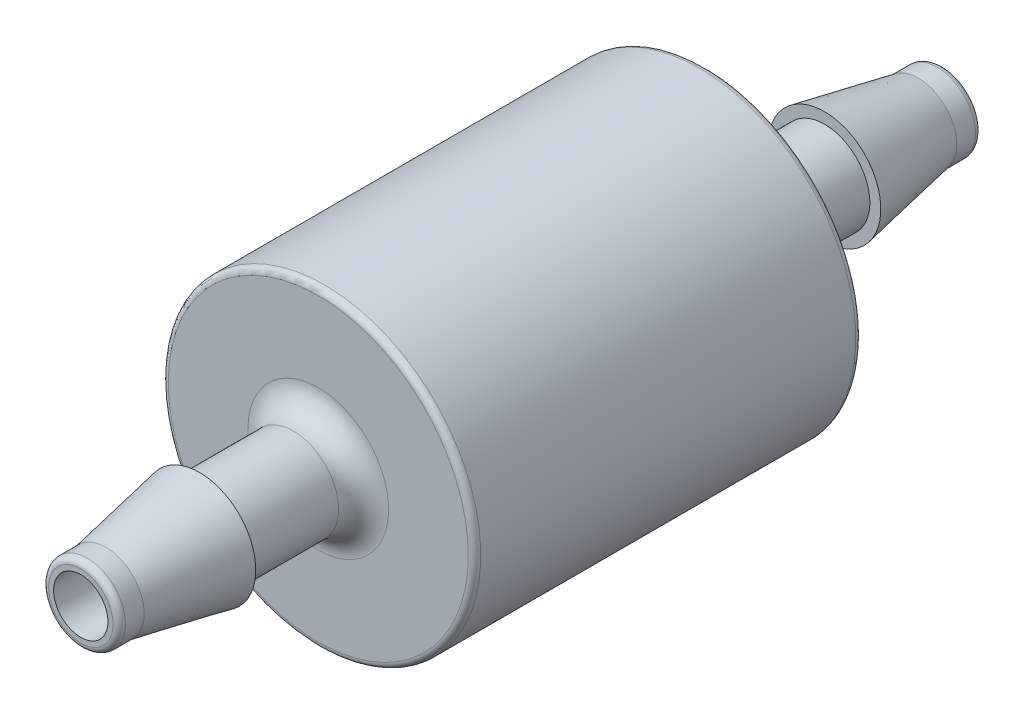
ISO-10303-21;
HEADER;
FILE_DESCRIPTION(('STEP AP214'),'2;1');
FILE_NAME('part.step','',(''),(''),'','','');
FILE_SCHEMA(('AUTOMOTIVE_DESIGN { 1 0 10303 214 1 1 1 1 }'));
ENDSEC;
DATA;
#1=APPLICATION_CONTEXT('core data for automotive mechanical design processes');
#2=APPLICATION_PROTOCOL_DEFINITION('international standard','automotive_design',2000,#1);
#3=PRODUCT_CONTEXT('',#1,'mechanical');
#4=PRODUCT('Part','Part','',(#3));
#5=PRODUCT_RELATED_PRODUCT_CATEGORY('part','',(#4));
#6=PRODUCT_DEFINITION_FORMATION('','',#4);
#7=PRODUCT_DEFINITION_CONTEXT('part definition',#1,'design');
#8=PRODUCT_DEFINITION('design','',#6,#7);
#9=PRODUCT_DEFINITION_SHAPE('','',#8);
#10=(LENGTH_UNIT() NAMED_UNIT(*) SI_UNIT(.MILLI.,.METRE.));
#11=(NAMED_UNIT(*) PLANE_ANGLE_UNIT() SI_UNIT($,.RADIAN.));
#12=(NAMED_UNIT(*) SI_UNIT($,.STERADIAN.) SOLID_ANGLE_UNIT());
#13=UNCERTAINTY_MEASURE_WITH_UNIT(LENGTH_MEASURE(1.E-05),#10,'distance_accuracy_value','');
#14=(GEOMETRIC_REPRESENTATION_CONTEXT(3) GLOBAL_UNCERTAINTY_ASSIGNED_CONTEXT((#13)) GLOBAL_UNIT_ASSIGNED_CONTEXT((#10,
#11,#12)) REPRESENTATION_CONTEXT('',''));
#15=CARTESIAN_POINT('',(0.,0.,0.));
#16=DIRECTION('',(0.,0.,1.));
#17=DIRECTION('',(1.,0.,0.));
#18=AXIS2_PLACEMENT_3D('',#15,#16,#17);
#19=CARTESIAN_POINT('',(0.,-2.286,12.7));
#20=DIRECTION('',(0.,0.,-1.));
#21=DIRECTION('',(-1.,0.,0.));
#22=AXIS2_PLACEMENT_3D('',#19,#20,#21);
#23=PLANE('',#22);
#24=CARTESIAN_POINT('',(0.,0.,12.7));
#25=DIRECTION('',(0.,0.,-1.));
#26=DIRECTION('',(-1.,0.,0.));
#27=AXIS2_PLACEMENT_3D('',#24,#25,#26);
#28=CIRCLE('',#27,2.28599999999999);
#29=CARTESIAN_POINT('',(-2.28599999999999,0.,12.7));
#30=VERTEX_POINT('',#29);
#31=EDGE_CURVE('E10',#30,#30,#28,.T.);
#32=ORIENTED_EDGE('',*,*,#31,.T.);
#33=EDGE_LOOP('',(#32));
#34=FACE_BOUND('',#33,.T.);
#35=CARTESIAN_POINT('',(0.,0.,12.7));
#36=DIRECTION('',(0.,0.,-1.));
#37=DIRECTION('',(-1.,0.,0.));
#38=AXIS2_PLACEMENT_3D('',#35,#36,#37);
#39=CIRCLE('',#38,1.84149999999999);
#40=CARTESIAN_POINT('',(-1.84149999999999,0.,12.7));
#41=VERTEX_POINT('',#40);
#42=EDGE_CURVE('E94',#41,#41,#39,.T.);
#43=ORIENTED_EDGE('',*,*,#42,.F.);
#44=EDGE_LOOP('',(#43));
#45=FACE_BOUND('',#44,.T.);
#46=ADVANCED_FACE('F30',(#34,#45),#23,.T.);
#47=CARTESIAN_POINT('',(0.,0.,12.7));
#48=DIRECTION('',(0.,0.,-1.));
#49=DIRECTION('',(-1.,0.,0.));
#50=AXIS2_PLACEMENT_3D('',#47,#48,#49);
#51=CONICAL_SURFACE('',#50,2.28599999999999,0.187761946513594);
#52=CARTESIAN_POINT('',(0.,0.,16.51));
#53=DIRECTION('',(0.,0.,-1.));
#54=DIRECTION('',(-1.,0.,0.));
#55=AXIS2_PLACEMENT_3D('',#52,#53,#54);
#56=CIRCLE('',#55,1.56209999999999);
#57=CARTESIAN_POINT('',(-1.56209999999999,0.,16.51));
#58=VERTEX_POINT('',#57);
#59=EDGE_CURVE('E36',#58,#58,#56,.T.);
#60=ORIENTED_EDGE('',*,*,#59,.T.);
#61=EDGE_LOOP('',(#60));
#62=FACE_BOUND('',#61,.T.);
#63=ORIENTED_EDGE('',*,*,#31,.F.);
#64=EDGE_LOOP('',(#63));
#65=FACE_BOUND('',#64,.T.);
#66=ADVANCED_FACE('F102',(#62,#65),#51,.T.);
#67=CARTESIAN_POINT('',(0.,0.,-17.526));
#68=DIRECTION('',(0.,0.,-1.));
#69=DIRECTION('',(-1.,0.,0.));
#70=AXIS2_PLACEMENT_3D('',#67,#68,#69);
#71=CYLINDRICAL_SURFACE('',#70,1.56209999999999);
#72=CARTESIAN_POINT('',(0.,0.,17.272));
#73=DIRECTION('',(0.,0.,-1.));
#74=DIRECTION('',(-1.,0.,0.));
#75=AXIS2_PLACEMENT_3D('',#72,#73,#74);
#76=CIRCLE('',#75,1.56209999999999);
#77=CARTESIAN_POINT('',(-1.56209999999999,0.,17.272));
#78=VERTEX_POINT('',#77);
#79=EDGE_CURVE('E40',#78,#78,#76,.T.);
#80=ORIENTED_EDGE('',*,*,#79,.T.);
#81=EDGE_LOOP('',(#80));
#82=FACE_BOUND('',#81,.T.);
#83=ORIENTED_EDGE('',*,*,#59,.F.);
#84=EDGE_LOOP('',(#83));
#85=FACE_BOUND('',#84,.T.);
#86=ADVANCED_FACE('F106',(#82,#85),#71,.T.);
#87=CARTESIAN_POINT('',(0.,0.,17.272));
#88=DIRECTION('',(0.,0.,-1.));
#89=DIRECTION('',(-1.,0.,0.));
#90=AXIS2_PLACEMENT_3D('',#87,#88,#89);
#91=TOROIDAL_SURFACE('',#90,1.30809999999999,0.254);
#92=CARTESIAN_POINT('',(0.,0.,17.526));
#93=DIRECTION('',(0.,0.,-1.));
#94=DIRECTION('',(-1.,0.,0.));
#95=AXIS2_PLACEMENT_3D('',#92,#93,#94);
#96=CIRCLE('',#95,1.30809999999999);
#97=CARTESIAN_POINT('',(-1.30809999999999,0.,17.526));
#98=VERTEX_POINT('',#97);
#99=EDGE_CURVE('E44',#98,#98,#96,.T.);
#100=ORIENTED_EDGE('',*,*,#99,.T.);
#101=EDGE_LOOP('',(#100));
#102=FACE_BOUND('',#101,.T.);
#103=ORIENTED_EDGE('',*,*,#79,.F.);
#104=EDGE_LOOP('',(#103));
#105=FACE_BOUND('',#104,.T.);
#106=ADVANCED_FACE('F110',(#102,#105),#91,.T.);
#107=CARTESIAN_POINT('',(0.,-1.1049,17.526));
#108=DIRECTION('',(0.,0.,1.));
#109=DIRECTION('',(1.,0.,0.));
#110=AXIS2_PLACEMENT_3D('',#107,#108,#109);
#111=PLANE('',#110);
#112=CARTESIAN_POINT('',(0.,0.,17.526));
#113=DIRECTION('',(0.,0.,-1.));
#114=DIRECTION('',(-1.,0.,0.));
#115=AXIS2_PLACEMENT_3D('',#112,#113,#114);
#116=CIRCLE('',#115,1.1049);
#117=CARTESIAN_POINT('',(-1.1049,0.,17.526));
#118=VERTEX_POINT('',#117);
#119=EDGE_CURVE('E49',#118,#118,#116,.T.);
#120=ORIENTED_EDGE('',*,*,#119,.T.);
#121=EDGE_LOOP('',(#120));
#122=FACE_BOUND('',#121,.T.);
#123=ORIENTED_EDGE('',*,*,#99,.F.);
#124=EDGE_LOOP('',(#123));
#125=FACE_BOUND('',#124,.T.);
#126=ADVANCED_FACE('F117',(#122,#125),#111,.T.);
#127=CARTESIAN_POINT('',(0.,0.,-17.526));
#128=DIRECTION('',(0.,0.,-1.));
#129=DIRECTION('',(-1.,0.,0.));
#130=AXIS2_PLACEMENT_3D('',#127,#128,#129);
#131=CYLINDRICAL_SURFACE('',#130,1.1049);
#132=CARTESIAN_POINT('',(0.,0.,-17.526));
#133=DIRECTION('',(0.,0.,-1.));
#134=DIRECTION('',(-1.,0.,0.));
#135=AXIS2_PLACEMENT_3D('',#132,#133,#134);
#136=CIRCLE('',#135,1.1049);
#137=CARTESIAN_POINT('',(-1.1049,0.,-17.526));
#138=VERTEX_POINT('',#137);
#139=EDGE_CURVE('E52',#138,#138,#136,.T.);
#140=ORIENTED_EDGE('',*,*,#139,.T.);
#141=EDGE_LOOP('',(#140));
#142=FACE_BOUND('',#141,.T.);
#143=ORIENTED_EDGE('',*,*,#119,.F.);
#144=EDGE_LOOP('',(#143));
#145=FACE_BOUND('',#144,.T.);
#146=ADVANCED_FACE('F121',(#142,#145),#131,.F.);
#147=CARTESIAN_POINT('',(0.,-1.1049,-17.526));
#148=DIRECTION('',(0.,0.,-1.));
#149=DIRECTION('',(-1.,0.,0.));
#150=AXIS2_PLACEMENT_3D('',#147,#148,#149);
#151=PLANE('',#150);
#152=CARTESIAN_POINT('',(0.,0.,-17.526));
#153=DIRECTION('',(0.,0.,-1.));
#154=DIRECTION('',(-1.,0.,0.));
#155=AXIS2_PLACEMENT_3D('',#152,#153,#154);
#156=CIRCLE('',#155,1.30809999999999);
#157=CARTESIAN_POINT('',(-1.30809999999999,0.,-17.526));
#158=VERTEX_POINT('',#157);
#159=EDGE_CURVE('E55',#158,#158,#156,.T.);
#160=ORIENTED_EDGE('',*,*,#159,.T.);
#161=EDGE_LOOP('',(#160));
#162=FACE_BOUND('',#161,.T.);
#163=ORIENTED_EDGE('',*,*,#139,.F.);
#164=EDGE_LOOP('',(#163));
#165=FACE_BOUND('',#164,.T.);
#166=ADVANCED_FACE('F125',(#162,#165),#151,.T.);
#167=CARTESIAN_POINT('',(0.,0.,-17.272));
#168=DIRECTION('',(0.,0.,-1.));
#169=DIRECTION('',(-1.,0.,0.));
#170=AXIS2_PLACEMENT_3D('',#167,#168,#169);
#171=TOROIDAL_SURFACE('',#170,1.30809999999999,0.254);
#172=CARTESIAN_POINT('',(0.,0.,-17.272));
#173=DIRECTION('',(0.,0.,-1.));
#174=DIRECTION('',(-1.,0.,0.));
#175=AXIS2_PLACEMENT_3D('',#172,#173,#174);
#176=CIRCLE('',#175,1.56209999999999);
#177=CARTESIAN_POINT('',(-1.56209999999999,0.,-17.272));
#178=VERTEX_POINT('',#177);
#179=EDGE_CURVE('E58',#178,#178,#176,.T.);
#180=ORIENTED_EDGE('',*,*,#179,.T.);
#181=EDGE_LOOP('',(#180));
#182=FACE_BOUND('',#181,.T.);
#183=ORIENTED_EDGE('',*,*,#159,.F.);
#184=EDGE_LOOP('',(#183));
#185=FACE_BOUND('',#184,.T.);
#186=ADVANCED_FACE('F129',(#182,#185),#171,.T.);
#187=CARTESIAN_POINT('',(0.,0.,-17.526));
#188=DIRECTION('',(0.,0.,-1.));
#189=DIRECTION('',(-1.,0.,0.));
#190=AXIS2_PLACEMENT_3D('',#187,#188,#189);
#191=CYLINDRICAL_SURFACE('',#190,1.56209999999999);
#192=CARTESIAN_POINT('',(0.,0.,-16.51));
#193=DIRECTION('',(0.,0.,-1.));
#194=DIRECTION('',(-1.,0.,0.));
#195=AXIS2_PLACEMENT_3D('',#192,#193,#194);
#196=CIRCLE('',#195,1.56209999999999);
#197=CARTESIAN_POINT('',(-1.56209999999999,0.,-16.51));
#198=VERTEX_POINT('',#197);
#199=EDGE_CURVE('E61',#198,#198,#196,.T.);
#200=ORIENTED_EDGE('',*,*,#199,.T.);
#201=EDGE_LOOP('',(#200));
#202=FACE_BOUND('',#201,.T.);
#203=ORIENTED_EDGE('',*,*,#179,.F.);
#204=EDGE_LOOP('',(#203));
#205=FACE_BOUND('',#204,.T.);
#206=ADVANCED_FACE('F133',(#202,#205),#191,.T.);
#207=CARTESIAN_POINT('',(0.,0.,-16.51));
#208=DIRECTION('',(0.,0.,1.));
#209=DIRECTION('',(1.,0.,0.));
#210=AXIS2_PLACEMENT_3D('',#207,#208,#209);
#211=CONICAL_SURFACE('',#210,1.56209999999999,0.187761946513594);
#212=CARTESIAN_POINT('',(0.,0.,-12.7));
#213=DIRECTION('',(0.,0.,-1.));
#214=DIRECTION('',(-1.,0.,0.));
#215=AXIS2_PLACEMENT_3D('',#212,#213,#214);
#216=CIRCLE('',#215,2.28599999999999);
#217=CARTESIAN_POINT('',(-2.28599999999999,0.,-12.7));
#218=VERTEX_POINT('',#217);
#219=EDGE_CURVE('E64',#218,#218,#216,.T.);
#220=ORIENTED_EDGE('',*,*,#219,.T.);
#221=EDGE_LOOP('',(#220));
#222=FACE_BOUND('',#221,.T.);
#223=ORIENTED_EDGE('',*,*,#199,.F.);
#224=EDGE_LOOP('',(#223));
#225=FACE_BOUND('',#224,.T.);
#226=ADVANCED_FACE('F137',(#222,#225),#211,.T.);
#227=CARTESIAN_POINT('',(0.,-2.286,-12.7));
#228=DIRECTION('',(0.,0.,1.));
#229=DIRECTION('',(1.,0.,0.));
#230=AXIS2_PLACEMENT_3D('',#227,#228,#229);
#231=PLANE('',#230);
#232=CARTESIAN_POINT('',(0.,0.,-12.7));
#233=DIRECTION('',(0.,0.,-1.));
#234=DIRECTION('',(-1.,0.,0.));
#235=AXIS2_PLACEMENT_3D('',#232,#233,#234);
#236=CIRCLE('',#235,1.84149999999999);
#237=CARTESIAN_POINT('',(-1.84149999999999,0.,-12.7));
#238=VERTEX_POINT('',#237);
#239=EDGE_CURVE('E67',#238,#238,#236,.T.);
#240=ORIENTED_EDGE('',*,*,#239,.T.);
#241=EDGE_LOOP('',(#240));
#242=FACE_BOUND('',#241,.T.);
#243=ORIENTED_EDGE('',*,*,#219,.F.);
#244=EDGE_LOOP('',(#243));
#245=FACE_BOUND('',#244,.T.);
#246=ADVANCED_FACE('F141',(#242,#245),#231,.T.);
#247=CARTESIAN_POINT('',(0.,0.,-17.526));
#248=DIRECTION('',(0.,0.,-1.));
#249=DIRECTION('',(-1.,0.,0.));
#250=AXIS2_PLACEMENT_3D('',#247,#248,#249);
#251=CYLINDRICAL_SURFACE('',#250,1.84149999999999);
#252=CARTESIAN_POINT('',(0.,0.,-8.89));
#253=DIRECTION('',(0.,0.,-1.));
#254=DIRECTION('',(-1.,0.,0.));
#255=AXIS2_PLACEMENT_3D('',#252,#253,#254);
#256=CIRCLE('',#255,1.84149999999999);
#257=CARTESIAN_POINT('',(-1.84149999999999,0.,-8.89));
#258=VERTEX_POINT('',#257);
#259=EDGE_CURVE('E70',#258,#258,#256,.T.);
#260=ORIENTED_EDGE('',*,*,#259,.T.);
#261=EDGE_LOOP('',(#260));
#262=FACE_BOUND('',#261,.T.);
#263=ORIENTED_EDGE('',*,*,#239,.F.);
#264=EDGE_LOOP('',(#263));
#265=FACE_BOUND('',#264,.T.);
#266=ADVANCED_FACE('F145',(#262,#265),#251,.T.);
#267=CARTESIAN_POINT('',(0.,0.,-8.89));
#268=DIRECTION('',(0.,0.,-1.));
#269=DIRECTION('',(-1.,0.,0.));
#270=AXIS2_PLACEMENT_3D('',#267,#268,#269);
#271=TOROIDAL_SURFACE('',#270,2.85749999999999,1.016);
#272=CARTESIAN_POINT('',(0.,0.,-7.874));
#273=DIRECTION('',(0.,0.,-1.));
#274=DIRECTION('',(-1.,0.,0.));
#275=AXIS2_PLACEMENT_3D('',#272,#273,#274);
#276=CIRCLE('',#275,2.85749999999999);
#277=CARTESIAN_POINT('',(-2.85749999999999,0.,-7.874));
#278=VERTEX_POINT('',#277);
#279=EDGE_CURVE('E73',#278,#278,#276,.T.);
#280=ORIENTED_EDGE('',*,*,#279,.T.);
#281=EDGE_LOOP('',(#280));
#282=FACE_BOUND('',#281,.T.);
#283=ORIENTED_EDGE('',*,*,#259,.F.);
#284=EDGE_LOOP('',(#283));
#285=FACE_BOUND('',#284,.T.);
#286=ADVANCED_FACE('F149',(#282,#285),#271,.F.);
#287=CARTESIAN_POINT('',(0.,-2.8575,-7.874));
#288=DIRECTION('',(0.,0.,-1.));
#289=DIRECTION('',(-1.,0.,0.));
#290=AXIS2_PLACEMENT_3D('',#287,#288,#289);
#291=PLANE('',#290);
#292=CARTESIAN_POINT('',(0.,0.,-7.874));
#293=DIRECTION('',(0.,0.,-1.));
#294=DIRECTION('',(-1.,0.,0.));
#295=AXIS2_PLACEMENT_3D('',#292,#293,#294);
#296=CIRCLE('',#295,6.09599999999999);
#297=CARTESIAN_POINT('',(-6.09599999999999,0.,-7.874));
#298=VERTEX_POINT('',#297);
#299=EDGE_CURVE('E76',#298,#298,#296,.T.);
#300=ORIENTED_EDGE('',*,*,#299,.T.);
#301=EDGE_LOOP('',(#300));
#302=FACE_BOUND('',#301,.T.);
#303=ORIENTED_EDGE('',*,*,#279,.F.);
#304=EDGE_LOOP('',(#303));
#305=FACE_BOUND('',#304,.T.);
#306=ADVANCED_FACE('F153',(#302,#305),#291,.T.);
#307=CARTESIAN_POINT('',(0.,0.,-7.62));
#308=DIRECTION('',(0.,0.,-1.));
#309=DIRECTION('',(-1.,0.,0.));
#310=AXIS2_PLACEMENT_3D('',#307,#308,#309);
#311=TOROIDAL_SURFACE('',#310,6.09599999999999,0.254);
#312=CARTESIAN_POINT('',(0.,0.,-7.62));
#313=DIRECTION('',(0.,0.,-1.));
#314=DIRECTION('',(-1.,0.,0.));
#315=AXIS2_PLACEMENT_3D('',#312,#313,#314);
#316=CIRCLE('',#315,6.34999999999999);
#317=CARTESIAN_POINT('',(-6.34999999999999,0.,-7.62));
#318=VERTEX_POINT('',#317);
#319=EDGE_CURVE('E79',#318,#318,#316,.T.);
#320=ORIENTED_EDGE('',*,*,#319,.T.);
#321=EDGE_LOOP('',(#320));
#322=FACE_BOUND('',#321,.T.);
#323=ORIENTED_EDGE('',*,*,#299,.F.);
#324=EDGE_LOOP('',(#323));
#325=FACE_BOUND('',#324,.T.);
#326=ADVANCED_FACE('F157',(#322,#325),#311,.T.);
#327=CARTESIAN_POINT('',(0.,0.,-17.526));
#328=DIRECTION('',(0.,0.,-1.));
#329=DIRECTION('',(-1.,0.,0.));
#330=AXIS2_PLACEMENT_3D('',#327,#328,#329);
#331=CYLINDRICAL_SURFACE('',#330,6.34999999999999);
#332=CARTESIAN_POINT('',(0.,0.,7.61999999999999));
#333=DIRECTION('',(0.,0.,-1.));
#334=DIRECTION('',(-1.,0.,0.));
#335=AXIS2_PLACEMENT_3D('',#332,#333,#334);
#336=CIRCLE('',#335,6.34999999999999);
#337=CARTESIAN_POINT('',(-6.34999999999999,0.,7.61999999999999));
#338=VERTEX_POINT('',#337);
#339=EDGE_CURVE('E82',#338,#338,#336,.T.);
#340=ORIENTED_EDGE('',*,*,#339,.T.);
#341=EDGE_LOOP('',(#340));
#342=FACE_BOUND('',#341,.T.);
#343=ORIENTED_EDGE('',*,*,#319,.F.);
#344=EDGE_LOOP('',(#343));
#345=FACE_BOUND('',#344,.T.);
#346=ADVANCED_FACE('F161',(#342,#345),#331,.T.);
#347=CARTESIAN_POINT('',(0.,0.,7.62));
#348=DIRECTION('',(0.,0.,-1.));
#349=DIRECTION('',(-1.,0.,0.));
#350=AXIS2_PLACEMENT_3D('',#347,#348,#349);
#351=TOROIDAL_SURFACE('',#350,6.09599999999999,0.254);
#352=CARTESIAN_POINT('',(0.,0.,7.874));
#353=DIRECTION('',(0.,0.,-1.));
#354=DIRECTION('',(-1.,0.,0.));
#355=AXIS2_PLACEMENT_3D('',#352,#353,#354);
#356=CIRCLE('',#355,6.09599999999999);
#357=CARTESIAN_POINT('',(-6.09599999999999,0.,7.874));
#358=VERTEX_POINT('',#357);
#359=EDGE_CURVE('E85',#358,#358,#356,.T.);
#360=ORIENTED_EDGE('',*,*,#359,.T.);
#361=EDGE_LOOP('',(#360));
#362=FACE_BOUND('',#361,.T.);
#363=ORIENTED_EDGE('',*,*,#339,.F.);
#364=EDGE_LOOP('',(#363));
#365=FACE_BOUND('',#364,.T.);
#366=ADVANCED_FACE('F165',(#362,#365),#351,.T.);
#367=CARTESIAN_POINT('',(0.,-2.8575,7.874));
#368=DIRECTION('',(0.,0.,1.));
#369=DIRECTION('',(1.,0.,0.));
#370=AXIS2_PLACEMENT_3D('',#367,#368,#369);
#371=PLANE('',#370);
#372=CARTESIAN_POINT('',(0.,0.,7.874));
#373=DIRECTION('',(0.,0.,-1.));
#374=DIRECTION('',(-1.,0.,0.));
#375=AXIS2_PLACEMENT_3D('',#372,#373,#374);
#376=CIRCLE('',#375,2.85749999999999);
#377=CARTESIAN_POINT('',(-2.85749999999999,0.,7.874));
#378=VERTEX_POINT('',#377);
#379=EDGE_CURVE('E88',#378,#378,#376,.T.);
#380=ORIENTED_EDGE('',*,*,#379,.T.);
#381=EDGE_LOOP('',(#380));
#382=FACE_BOUND('',#381,.T.);
#383=ORIENTED_EDGE('',*,*,#359,.F.);
#384=EDGE_LOOP('',(#383));
#385=FACE_BOUND('',#384,.T.);
#386=ADVANCED_FACE('F169',(#382,#385),#371,.T.);
#387=CARTESIAN_POINT('',(0.,0.,8.89));
#388=DIRECTION('',(0.,0.,-1.));
#389=DIRECTION('',(-1.,0.,0.));
#390=AXIS2_PLACEMENT_3D('',#387,#388,#389);
#391=TOROIDAL_SURFACE('',#390,2.85749999999999,1.016);
#392=CARTESIAN_POINT('',(0.,0.,8.89));
#393=DIRECTION('',(0.,0.,-1.));
#394=DIRECTION('',(-1.,0.,0.));
#395=AXIS2_PLACEMENT_3D('',#392,#393,#394);
#396=CIRCLE('',#395,1.84149999999999);
#397=CARTESIAN_POINT('',(-1.84149999999999,0.,8.89));
#398=VERTEX_POINT('',#397);
#399=EDGE_CURVE('E91',#398,#398,#396,.T.);
#400=ORIENTED_EDGE('',*,*,#399,.T.);
#401=EDGE_LOOP('',(#400));
#402=FACE_BOUND('',#401,.T.);
#403=ORIENTED_EDGE('',*,*,#379,.F.);
#404=EDGE_LOOP('',(#403));
#405=FACE_BOUND('',#404,.T.);
#406=ADVANCED_FACE('F173',(#402,#405),#391,.F.);
#407=CARTESIAN_POINT('',(0.,0.,-17.526));
#408=DIRECTION('',(0.,0.,-1.));
#409=DIRECTION('',(-1.,0.,0.));
#410=AXIS2_PLACEMENT_3D('',#407,#408,#409);
#411=CYLINDRICAL_SURFACE('',#410,1.84149999999999);
#412=ORIENTED_EDGE('',*,*,#42,.T.);
#413=EDGE_LOOP('',(#412));
#414=FACE_BOUND('',#413,.T.);
#415=ORIENTED_EDGE('',*,*,#399,.F.);
#416=EDGE_LOOP('',(#415));
#417=FACE_BOUND('',#416,.T.);
#418=ADVANCED_FACE('F98',(#414,#417),#411,.T.);
#419=CLOSED_SHELL('',(#46,#66,#86,#106,#126,#146,#166,#186,#206,#226,#246,#266,#286,#306,#326,
#346,#366,#386,#406,#418));
#420=MANIFOLD_SOLID_BREP('B2',#419);
#421=ADVANCED_BREP_SHAPE_REPRESENTATION('',(#18,#420),#14);
#422=SHAPE_DEFINITION_REPRESENTATION(#9,#421);
ENDSEC;
END-ISO-10303-21;
